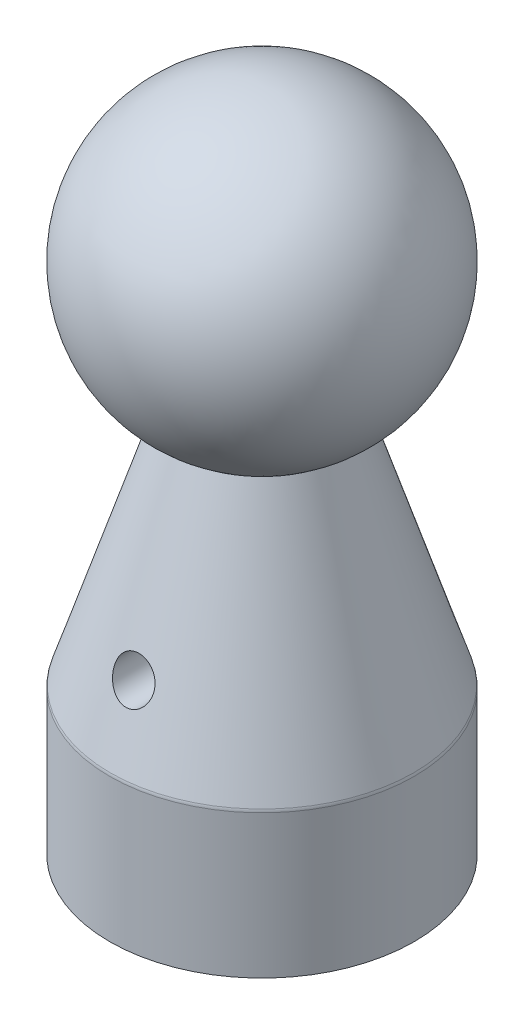
ISO-10303-21;
HEADER;
FILE_DESCRIPTION(('STEP AP214'),'2;1');
FILE_NAME('part.step','',(''),(''),'','','');
FILE_SCHEMA(('AUTOMOTIVE_DESIGN { 1 0 10303 214 1 1 1 1 }'));
ENDSEC;
DATA;
#1=APPLICATION_CONTEXT('core data for automotive mechanical design processes');
#2=APPLICATION_PROTOCOL_DEFINITION('international standard','automotive_design',2000,#1);
#3=PRODUCT_CONTEXT('',#1,'mechanical');
#4=PRODUCT('Part','Part','',(#3));
#5=PRODUCT_RELATED_PRODUCT_CATEGORY('part','',(#4));
#6=PRODUCT_DEFINITION_FORMATION('','',#4);
#7=PRODUCT_DEFINITION_CONTEXT('part definition',#1,'design');
#8=PRODUCT_DEFINITION('design','',#6,#7);
#9=PRODUCT_DEFINITION_SHAPE('','',#8);
#10=(LENGTH_UNIT() NAMED_UNIT(*) SI_UNIT(.MILLI.,.METRE.));
#11=(NAMED_UNIT(*) PLANE_ANGLE_UNIT() SI_UNIT($,.RADIAN.));
#12=(NAMED_UNIT(*) SI_UNIT($,.STERADIAN.) SOLID_ANGLE_UNIT());
#13=UNCERTAINTY_MEASURE_WITH_UNIT(LENGTH_MEASURE(1.E-05),#10,'distance_accuracy_value','');
#14=(GEOMETRIC_REPRESENTATION_CONTEXT(3) GLOBAL_UNCERTAINTY_ASSIGNED_CONTEXT((#13)) GLOBAL_UNIT_ASSIGNED_CONTEXT((#10,
#11,#12)) REPRESENTATION_CONTEXT('',''));
#15=CARTESIAN_POINT('',(0.,0.,0.));
#16=DIRECTION('',(0.,0.,1.));
#17=DIRECTION('',(1.,0.,0.));
#18=AXIS2_PLACEMENT_3D('',#15,#16,#17);
#19=CARTESIAN_POINT('',(0.,85.598,0.));
#20=DIRECTION('',(0.,-1.,0.));
#21=DIRECTION('',(1.,0.,0.));
#22=AXIS2_PLACEMENT_3D('',#19,#20,#21);
#23=SPHERICAL_SURFACE('',#22,25.4);
#24=CARTESIAN_POINT('',(0.,63.6009547438753,0.));
#25=DIRECTION('',(0.,-1.,0.));
#26=DIRECTION('',(0.,0.,-1.));
#27=AXIS2_PLACEMENT_3D('',#24,#25,#26);
#28=CIRCLE('',#27,12.7);
#29=CARTESIAN_POINT('',(0.,63.6009547438753,-12.7));
#30=VERTEX_POINT('',#29);
#31=EDGE_CURVE('E116',#30,#30,#28,.T.);
#32=ORIENTED_EDGE('',*,*,#31,.F.);
#33=EDGE_LOOP('',(#32));
#34=FACE_BOUND('',#33,.T.);
#35=ADVANCED_FACE('F33',(#34),#23,.T.);
#36=CARTESIAN_POINT('',(0.,24.13,0.));
#37=DIRECTION('',(0.,-1.,0.));
#38=DIRECTION('',(0.,0.,-1.));
#39=AXIS2_PLACEMENT_3D('',#36,#37,#38);
#40=CONICAL_SURFACE('',#39,25.4,0.311294640774793);
#41=CARTESIAN_POINT('',(0.,24.3690295241415,0.));
#42=DIRECTION('',(0.,1.,0.));
#43=DIRECTION('',(0.,0.,1.));
#44=AXIS2_PLACEMENT_3D('',#41,#42,#43);
#45=CIRCLE('',#44,25.3230909164398);
#46=CARTESIAN_POINT('',(0.,24.3690295241415,25.3230909164398));
#47=VERTEX_POINT('',#46);
#48=EDGE_CURVE('E91',#47,#47,#45,.T.);
#49=ORIENTED_EDGE('',*,*,#48,.T.);
#50=EDGE_LOOP('',(#49));
#51=FACE_BOUND('',#50,.T.);
#52=CARTESIAN_POINT('',(-1.60081995492145,32.9171004117086,-22.515866046003));
#53=CARTESIAN_POINT('',(-1.77169788196926,33.0095127195048,-22.4739061474421));
#54=CARTESIAN_POINT('',(-1.93358693573494,33.1162395795657,-22.4259538926566));
#55=CARTESIAN_POINT('',(-2.2352223082019,33.3541231544109,-22.3209881055093));
#56=CARTESIAN_POINT('',(-2.37491986401619,33.4853323278317,-22.2639551550318));
#57=CARTESIAN_POINT('',(-2.62859309077032,33.7673105377345,-22.1440686216835));
#58=CARTESIAN_POINT('',(-2.74266338501602,33.9180042707433,-22.0812377013193));
#59=CARTESIAN_POINT('',(-2.9435824800794,34.2351949360935,-21.9523880493859));
#60=CARTESIAN_POINT('',(-3.03043976139563,34.4016869240477,-21.8863703183512));
#61=CARTESIAN_POINT('',(-3.17934781132035,34.7561980424798,-21.7499833022259));
#62=CARTESIAN_POINT('',(-3.23974441329069,34.9448999504454,-21.6795767139967));
#63=CARTESIAN_POINT('',(-3.32667204596179,35.3307299516955,-21.5408036008511));
#64=CARTESIAN_POINT('',(-3.35319541140584,35.5278599417646,-21.472437541108));
#65=CARTESIAN_POINT('',(-3.37113288143676,35.9275157236945,-21.3394537909924));
#66=CARTESIAN_POINT('',(-3.36214497733018,36.1300773657507,-21.2748874668051));
#67=CARTESIAN_POINT('',(-3.30741898856899,36.532269053735,-21.1524944705222));
#68=CARTESIAN_POINT('',(-3.26169057747519,36.7318998572492,-21.09466602897));
#69=CARTESIAN_POINT('',(-3.1364863619104,37.1134981785572,-20.9895012770649));
#70=CARTESIAN_POINT('',(-3.0584787035577,37.2958545666885,-20.9418308310241));
#71=CARTESIAN_POINT('',(-2.87055780889468,37.6455049635914,-20.8548579218339));
#72=CARTESIAN_POINT('',(-2.76065417326665,37.8128034849545,-20.8155529468414));
#73=CARTESIAN_POINT('',(-2.51796421706855,38.1186354962833,-20.7471463477041));
#74=CARTESIAN_POINT('',(-2.38655756202974,38.258174774934,-20.7176401635573));
#75=CARTESIAN_POINT('',(-2.10115061389559,38.5134811164614,-20.6659592279342));
#76=CARTESIAN_POINT('',(-1.94715357152892,38.6292515938973,-20.6437834231166));
#77=CARTESIAN_POINT('',(-1.62530092888828,38.8304792241158,-20.6066348511495));
#78=CARTESIAN_POINT('',(-1.45790487702004,38.9166408309097,-20.5914911481932));
#79=CARTESIAN_POINT('',(-1.11073681107022,39.0599699636262,-20.5669486567397));
#80=CARTESIAN_POINT('',(-0.930965341812602,39.1171387650223,-20.5575496155152));
#81=CARTESIAN_POINT('',(-0.565400121999948,39.2004257332904,-20.5440315486752));
#82=CARTESIAN_POINT('',(-0.379652457237204,39.2267409370291,-20.5398790045709));
#83=CARTESIAN_POINT('',(-0.00632056599214067,39.2481836031241,-20.5364870241591));
#84=CARTESIAN_POINT('',(0.181263651493457,39.2433112181829,-20.537247563796));
#85=CARTESIAN_POINT('',(0.55287375808255,39.202533516835,-20.5437292313035));
#86=CARTESIAN_POINT('',(0.73690087383713,39.1666391007283,-20.5494486167725));
#87=CARTESIAN_POINT('',(1.09623731394046,39.0649313948789,-20.5661863953247));
#88=CARTESIAN_POINT('',(1.27154676882699,38.9991185532828,-20.5772047090355));
#89=CARTESIAN_POINT('',(1.60847823500165,38.8396152490303,-20.6050902044283));
#90=CARTESIAN_POINT('',(1.77010055573184,38.74592541684,-20.6219572538366));
#91=CARTESIAN_POINT('',(2.07512852699926,38.5336174874511,-20.6621559744277));
#92=CARTESIAN_POINT('',(2.21853469017169,38.4150000920083,-20.6854874636308));
#93=CARTESIAN_POINT('',(2.48357603176383,38.1562760590021,-20.7391874785798));
#94=CARTESIAN_POINT('',(2.60515704448015,38.0161175164329,-20.7695730945431));
#95=CARTESIAN_POINT('',(2.8230490127132,37.7189503224156,-20.8375736396536));
#96=CARTESIAN_POINT('',(2.91935904832056,37.5619410578638,-20.8751888318841));
#97=CARTESIAN_POINT('',(3.0858474693396,37.2334311439929,-20.9580783779635));
#98=CARTESIAN_POINT('',(3.15561565162616,37.0617496135242,-21.0034583805546));
#99=CARTESIAN_POINT('',(3.2658302271823,36.7110199060286,-21.1008035995783));
#100=CARTESIAN_POINT('',(3.30627157775522,36.5319704676935,-21.1527699467173));
#101=CARTESIAN_POINT('',(3.35855084882029,36.1645970180641,-21.2642112235703));
#102=CARTESIAN_POINT('',(3.36926304402898,35.9761765054735,-21.3238942158727));
#103=CARTESIAN_POINT('',(3.35940211055684,35.6015489817989,-21.4474652555152));
#104=CARTESIAN_POINT('',(3.33882046707852,35.4153425870529,-21.5113544428009));
#105=CARTESIAN_POINT('',(3.26560197709921,35.040406664999,-21.644606411587));
#106=CARTESIAN_POINT('',(3.21140469251208,34.8520214159268,-21.7140828651945));
#107=CARTESIAN_POINT('',(3.07120170604291,34.487359025658,-21.8528453565399));
#108=CARTESIAN_POINT('',(2.98518725657129,34.3110852301183,-21.9221313366279));
#109=CARTESIAN_POINT('',(2.7805755887529,33.9708231108567,-22.0593862312286));
#110=CARTESIAN_POINT('',(2.66118432723226,33.8072772221322,-22.127273180414));
#111=CARTESIAN_POINT('',(2.39339471777119,33.5027715202075,-22.2563771665706));
#112=CARTESIAN_POINT('',(2.24499951945429,33.3618092576061,-22.3175949266458));
#113=CARTESIAN_POINT('',(1.92853808155096,33.112281592432,-22.4277019918914));
#114=CARTESIAN_POINT('',(1.76138865552553,33.0027206893357,-22.476960017018));
#115=CARTESIAN_POINT('',(1.40775605049878,32.8140234262954,-22.562701301982));
#116=CARTESIAN_POINT('',(1.2212876887206,32.7348639652347,-22.5991942597112));
#117=CARTESIAN_POINT('',(0.85206777303415,32.6163969662248,-22.6541281515917));
#118=CARTESIAN_POINT('',(0.670441153247138,32.5741883610721,-22.6738782517462));
#119=CARTESIAN_POINT('',(0.301712015868256,32.520385283012,-22.6990903192571));
#120=CARTESIAN_POINT('',(0.114610949725953,32.5087827685054,-22.7045560397602));
#121=CARTESIAN_POINT('',(-0.245440837249479,32.5164763281566,-22.7009415887368));
#122=CARTESIAN_POINT('',(-0.418453693272142,32.5336385928087,-22.6928659157828));
#123=CARTESIAN_POINT('',(-0.758664327321565,32.5940878879045,-22.664577207721));
#124=CARTESIAN_POINT('',(-0.92586890296361,32.6373432110716,-22.6443789037167));
#125=CARTESIAN_POINT('',(-1.17685421401854,32.7230631536632,-22.6046981440832));
#126=CARTESIAN_POINT('',(-1.26424186677273,32.7570818623425,-22.5890031842886));
#127=CARTESIAN_POINT('',(-1.43537750558153,32.8320105609227,-22.5546170989774));
#128=CARTESIAN_POINT('',(-1.51912599693699,32.8729195902253,-22.5359263911236));
#129=CARTESIAN_POINT('',(-1.60081995492145,32.9171004117086,-22.515866046003));
#130=B_SPLINE_CURVE_WITH_KNOTS('',3,(#52,#53,#54,#55,#56,#57,#58,#59,#60,#61,#62,#63,#64,#65,
#66,#67,#68,#69,#70,#71,#72,#73,#74,#75,#76,#77,#78,#79,#80,#81,#82,#83,#84,#85,#86,#87,#88,#89,
#90,#91,#92,#93,#94,#95,#96,#97,#98,#99,#100,#101,#102,#103,#104,#105,#106,#107,#108,#109,#110,
#111,#112,#113,#114,#115,#116,#117,#118,#119,#120,#121,#122,#123,#124,#125,#126,#127,#128,#129),
.UNSPECIFIED.,.T.,.F.,(4,2,2,2,2,2,2,2,2,2,2,2,2,2,2,2,2,2,2,2,2,2,2,2,2,2,2,2,2,2,2,2,2,2,2,2,
2,2,4),(0.,0.595860698813477,1.19301313291908,1.7879230813272,2.38264745077268,3.01054918118957,
3.63859297584696,4.2737668574799,4.90877355632428,5.51761574019164,6.12627485242643,
6.70520855554136,7.2840590323879,7.84798868100089,8.41189351864113,8.97217719281128,
9.53245812369163,10.092542267057,10.6526180212263,11.2126811096847,11.7727284334741,
12.3341470257949,12.8955860519357,13.4653800602326,14.0352720203819,14.6264669349581,
15.2178227376222,15.838926395377,16.4602009421163,17.097740012527,17.7352098891058,
18.3493886916542,18.9630998709384,19.5226360074754,20.0820251140057,20.6017263175086,
21.120797268762,21.4057082659504,21.6905795757472),.UNSPECIFIED.);
#131=CARTESIAN_POINT('',(-1.60081995492145,32.9171004117086,-22.515866046003));
#132=VERTEX_POINT('',#131);
#133=EDGE_CURVE('E105',#132,#132,#130,.T.);
#134=ORIENTED_EDGE('',*,*,#133,.F.);
#135=EDGE_LOOP('',(#134));
#136=FACE_BOUND('',#135,.T.);
#137=CARTESIAN_POINT('',(-2.21054354102512,33.3397671608585,22.3275451101706));
#138=CARTESIAN_POINT('',(-2.07654075808737,33.2230442538149,22.3785512016898));
#139=CARTESIAN_POINT('',(-1.93248495105923,33.1162562442471,22.426051927024));
#140=CARTESIAN_POINT('',(-1.62711138176537,32.9259830443976,22.5116527733888));
#141=CARTESIAN_POINT('',(-1.46579197316271,32.8425000793373,22.5497519967011));
#142=CARTESIAN_POINT('',(-1.12919560091443,32.7018316209413,22.6144294404377));
#143=CARTESIAN_POINT('',(-0.953874754481708,32.6447329434331,22.6409696103004));
#144=CARTESIAN_POINT('',(-0.594815213300432,32.5598532980217,22.6805626317122));
#145=CARTESIAN_POINT('',(-0.411079713177631,32.5320612985411,22.6936205581893));
#146=CARTESIAN_POINT('',(-0.0509748570106106,32.5078093364224,22.7050121743618));
#147=CARTESIAN_POINT('',(0.125265214863852,32.5097584990166,22.7040934904253));
#148=CARTESIAN_POINT('',(0.47473067161913,32.5410364073462,22.6894094313141));
#149=CARTESIAN_POINT('',(0.647956349157053,32.5703624798742,22.675645310427));
#150=CARTESIAN_POINT('',(0.983042728128543,32.6542306092878,22.6365581239452));
#151=CARTESIAN_POINT('',(1.14506137164754,32.7082570153763,22.6114715596518));
#152=CARTESIAN_POINT('',(1.45751027468657,32.8392489788271,22.5512504412025));
#153=CARTESIAN_POINT('',(1.60793847465863,32.9162186012767,22.5161141064693));
#154=CARTESIAN_POINT('',(1.90149787911811,33.0950636775883,22.4355272552635));
#155=CARTESIAN_POINT('',(2.04384483655963,33.1980246675297,22.389635977981));
#156=CARTESIAN_POINT('',(2.30952364141363,33.4233076458578,22.2909225769689));
#157=CARTESIAN_POINT('',(2.43284848916833,33.5456367278198,22.2380979150999));
#158=CARTESIAN_POINT('',(2.66821864596592,33.8178149622426,22.1229388725166));
#159=CARTESIAN_POINT('',(2.77836063459523,33.9691302544568,22.060177094001));
#160=CARTESIAN_POINT('',(2.97177127866029,34.2869636306225,21.9317633193434));
#161=CARTESIAN_POINT('',(3.05502964107708,34.4534875063026,21.8661102271018));
#162=CARTESIAN_POINT('',(3.19764364568196,34.8094069717724,21.7299861504662));
#163=CARTESIAN_POINT('',(3.25502309916537,34.9995874558643,21.6594871930031));
#164=CARTESIAN_POINT('',(3.33559771885762,35.3879045058658,21.5208001329401));
#165=CARTESIAN_POINT('',(3.35878899031304,35.5860419756028,21.4526122944897));
#166=CARTESIAN_POINT('',(3.36973766131548,35.9864961357795,21.3204585637588));
#167=CARTESIAN_POINT('',(3.35721264919334,36.1888335065038,21.2565304339693));
#168=CARTESIAN_POINT('',(3.29547162035742,36.5899599447216,21.1355759054749));
#169=CARTESIAN_POINT('',(3.24626548672073,36.7887499532193,21.0785476525303));
#170=CARTESIAN_POINT('',(3.11452989348966,37.1677766672248,20.9751233190894));
#171=CARTESIAN_POINT('',(3.03351383522905,37.348443179548,20.9283771043999));
#172=CARTESIAN_POINT('',(2.83996689902301,37.69419808514,20.8432465280885));
#173=CARTESIAN_POINT('',(2.72744519773123,37.8592909958427,20.8048597373949));
#174=CARTESIAN_POINT('',(2.48004217629906,38.1605099138499,20.7381583417516));
#175=CARTESIAN_POINT('',(2.3464974471831,38.2976475689645,20.7094479302694));
#176=CARTESIAN_POINT('',(2.05730255517777,38.547824564716,20.6592796554673));
#177=CARTESIAN_POINT('',(1.90165547303058,38.6608672583524,20.6378207827963));
#178=CARTESIAN_POINT('',(1.57687198587387,38.8566173865141,20.601975647778));
#179=CARTESIAN_POINT('',(1.40816053093459,38.9400013950946,20.587428692342));
#180=CARTESIAN_POINT('',(1.05886550308319,39.0775973903848,20.5640151126512));
#181=CARTESIAN_POINT('',(0.878282405168741,39.1318105434568,20.5551482612816));
#182=CARTESIAN_POINT('',(0.511514882989358,39.2091461566815,20.5426434776394));
#183=CARTESIAN_POINT('',(0.325369453576461,39.2324488279581,20.5389752283563));
#184=CARTESIAN_POINT('',(-0.048239977003703,39.2478437495606,20.5365420952787));
#185=CARTESIAN_POINT('',(-0.235703972165438,39.2399361419449,20.5377771891658));
#186=CARTESIAN_POINT('',(-0.60657449616069,39.1931569978996,20.5452284438233));
#187=CARTESIAN_POINT('',(-0.789982119993264,39.154293925252,20.5514432430552));
#188=CARTESIAN_POINT('',(-1.14758279494182,39.0468059188768,20.5692179998535));
#189=CARTESIAN_POINT('',(-1.32177599747469,38.9781814743764,20.580777869556));
#190=CARTESIAN_POINT('',(-1.65601432942238,38.8133014228978,20.6098062663162));
#191=CARTESIAN_POINT('',(-1.81605964381611,38.7170461772531,20.6272747161067));
#192=CARTESIAN_POINT('',(-2.11752446769141,38.4999385387382,20.6687332801189));
#193=CARTESIAN_POINT('',(-2.25894448107946,38.3790868115498,20.6927232178482));
#194=CARTESIAN_POINT('',(-2.51971315098049,38.1162499376552,20.7477871803155));
#195=CARTESIAN_POINT('',(-2.63899976772579,37.974207342525,20.7788805882415));
#196=CARTESIAN_POINT('',(-2.85203980353185,37.6737151365774,20.8483029815748));
#197=CARTESIAN_POINT('',(-2.94579206950095,37.515264785257,20.8866322936122));
#198=CARTESIAN_POINT('',(-3.10703314078409,37.1841666347855,20.9709623431802));
#199=CARTESIAN_POINT('',(-3.17408276332521,37.011333815121,21.0170749009808));
#200=CARTESIAN_POINT('',(-3.2787249398078,36.65877290623,21.1158098322233));
#201=CARTESIAN_POINT('',(-3.3163130187414,36.4790437738478,21.1684331932069));
#202=CARTESIAN_POINT('',(-3.36274714308496,36.1105611152648,21.2811479602852));
#203=CARTESIAN_POINT('',(-3.37043399708605,35.9217260845262,21.3414485507486));
#204=CARTESIAN_POINT('',(-3.35446301753251,35.546706008547,21.466100945559));
#205=CARTESIAN_POINT('',(-3.33079199494391,35.3605221116631,21.5304544437019));
#206=CARTESIAN_POINT('',(-3.25121918354555,34.9860820586728,21.6644539409375));
#207=CARTESIAN_POINT('',(-3.19375181638865,34.7981951116974,21.7342031627171));
#208=CARTESIAN_POINT('',(-3.04704323589227,34.4351312120184,21.873205478554));
#209=CARTESIAN_POINT('',(-2.95781479811176,34.25994918295,21.9424587606888));
#210=CARTESIAN_POINT('',(-2.76646671555921,33.9538691651925,22.0665736873455));
#211=CARTESIAN_POINT('',(-2.66877510588213,33.8203940272344,22.1219496888089));
#212=CARTESIAN_POINT('',(-2.45386852685771,33.5682707567345,22.2284330991398));
#213=CARTESIAN_POINT('',(-2.33665818761639,33.4496191195134,22.2795415160293));
#214=CARTESIAN_POINT('',(-2.21054354102512,33.3397671608585,22.3275451101706));
#215=B_SPLINE_CURVE_WITH_KNOTS('',3,(#137,#138,#139,#140,#141,#142,#143,#144,#145,#146,#147,
#148,#149,#150,#151,#152,#153,#154,#155,#156,#157,#158,#159,#160,#161,#162,#163,#164,#165,#166,
#167,#168,#169,#170,#171,#172,#173,#174,#175,#176,#177,#178,#179,#180,#181,#182,#183,#184,#185,
#186,#187,#188,#189,#190,#191,#192,#193,#194,#195,#196,#197,#198,#199,#200,#201,#202,#203,#204,
#205,#206,#207,#208,#209,#210,#211,#212,#213,#214),.UNSPECIFIED.,.T.,.F.,(4,2,2,2,2,2,2,2,2,2,2,
2,2,2,2,2,2,2,2,2,2,2,2,2,2,2,2,2,2,2,2,2,2,2,2,2,2,2,4),(0.,0.554108117323079,1.10826912413037,
1.66424080099584,2.22000312501987,2.7461466236383,3.2722387525596,3.78781699986994,
4.30348665187179,4.84592716719068,5.38856681321316,5.9782261511173,6.56811098678951,
7.1975342520022,7.8270292162313,8.46151541940805,9.09583073329892,9.70304762820729,
10.3100878426115,10.8879154840392,11.4656626637244,12.0292267432099,12.5927682875767,
13.153009674495,13.7132485113909,14.2733342214513,14.8334107249873,15.3934799046268,
15.9535339285117,16.5151348176174,17.0767610635446,17.6472766792862,18.2178789356806,
18.8103936076067,19.4031575686633,20.0258221759135,20.6482366053327,21.1698504478148,
21.6913407322518),.UNSPECIFIED.);
#216=CARTESIAN_POINT('',(-2.21054354102512,33.3397671608585,22.3275451101706));
#217=VERTEX_POINT('',#216);
#218=EDGE_CURVE('E111',#217,#217,#215,.T.);
#219=ORIENTED_EDGE('',*,*,#218,.F.);
#220=EDGE_LOOP('',(#219));
#221=FACE_BOUND('',#220,.T.);
#222=ORIENTED_EDGE('',*,*,#31,.T.);
#223=EDGE_LOOP('',(#222));
#224=FACE_BOUND('',#223,.T.);
#225=ADVANCED_FACE('F61',(#51,#136,#221,#224),#40,.T.);
#226=CARTESIAN_POINT('',(0.,0.,0.));
#227=DIRECTION('',(0.,-1.,0.));
#228=DIRECTION('',(0.,0.,-1.));
#229=AXIS2_PLACEMENT_3D('',#226,#227,#228);
#230=CYLINDRICAL_SURFACE('',#229,25.4);
#231=CARTESIAN_POINT('',(0.,23.8789021693734,0.));
#232=DIRECTION('',(0.,1.,0.));
#233=DIRECTION('',(0.,0.,1.));
#234=AXIS2_PLACEMENT_3D('',#231,#232,#233);
#235=CIRCLE('',#234,25.4);
#236=CARTESIAN_POINT('',(0.,23.8789021693734,25.4));
#237=VERTEX_POINT('',#236);
#238=EDGE_CURVE('E95',#237,#237,#235,.F.);
#239=ORIENTED_EDGE('',*,*,#238,.T.);
#240=EDGE_LOOP('',(#239));
#241=FACE_BOUND('',#240,.T.);
#242=CARTESIAN_POINT('',(0.,0.,0.));
#243=DIRECTION('',(0.,-1.,0.));
#244=DIRECTION('',(0.,0.,-1.));
#245=AXIS2_PLACEMENT_3D('',#242,#243,#244);
#246=CIRCLE('',#245,25.4);
#247=CARTESIAN_POINT('',(0.,0.,-25.4));
#248=VERTEX_POINT('',#247);
#249=EDGE_CURVE('E108',#248,#248,#246,.T.);
#250=ORIENTED_EDGE('',*,*,#249,.F.);
#251=EDGE_LOOP('',(#250));
#252=FACE_BOUND('',#251,.T.);
#253=ADVANCED_FACE('F67',(#241,#252),#230,.T.);
#254=CARTESIAN_POINT('',(25.4,0.,0.));
#255=DIRECTION('',(0.,-1.,0.));
#256=DIRECTION('',(0.,0.,-1.));
#257=AXIS2_PLACEMENT_3D('',#254,#255,#256);
#258=PLANE('',#257);
#259=CARTESIAN_POINT('',(0.,0.,0.));
#260=DIRECTION('',(0.,-1.,0.));
#261=DIRECTION('',(0.,0.,-1.));
#262=AXIS2_PLACEMENT_3D('',#259,#260,#261);
#263=CIRCLE('',#262,17.6149);
#264=CARTESIAN_POINT('',(0.,0.,-17.6149));
#265=VERTEX_POINT('',#264);
#266=EDGE_CURVE('E86',#265,#265,#263,.F.);
#267=ORIENTED_EDGE('',*,*,#266,.T.);
#268=EDGE_LOOP('',(#267));
#269=FACE_BOUND('',#268,.T.);
#270=ORIENTED_EDGE('',*,*,#249,.T.);
#271=EDGE_LOOP('',(#270));
#272=FACE_BOUND('',#271,.T.);
#273=ADVANCED_FACE('F132',(#269,#272),#258,.T.);
#274=CARTESIAN_POINT('',(0.,0.,0.));
#275=DIRECTION('',(0.,-1.,0.));
#276=DIRECTION('',(0.,0.,-1.));
#277=AXIS2_PLACEMENT_3D('',#274,#275,#276);
#278=CYLINDRICAL_SURFACE('',#277,17.145);
#279=CARTESIAN_POINT('',(0.,0.469900000000006,0.));
#280=DIRECTION('',(0.,-1.,0.));
#281=DIRECTION('',(0.,0.,-1.));
#282=AXIS2_PLACEMENT_3D('',#279,#280,#281);
#283=CIRCLE('',#282,17.145);
#284=CARTESIAN_POINT('',(0.,0.469900000000006,-17.145));
#285=VERTEX_POINT('',#284);
#286=EDGE_CURVE('E89',#285,#285,#283,.T.);
#287=ORIENTED_EDGE('',*,*,#286,.T.);
#288=EDGE_LOOP('',(#287));
#289=FACE_BOUND('',#288,.T.);
#290=CARTESIAN_POINT('',(0.,0.507999999999999,0.));
#291=DIRECTION('',(0.,-1.,0.));
#292=DIRECTION('',(0.,0.,-1.));
#293=AXIS2_PLACEMENT_3D('',#290,#291,#292);
#294=CIRCLE('',#293,17.145);
#295=CARTESIAN_POINT('',(0.,0.507999999999999,-17.145));
#296=VERTEX_POINT('',#295);
#297=EDGE_CURVE('E104',#296,#296,#294,.T.);
#298=ORIENTED_EDGE('',*,*,#297,.F.);
#299=EDGE_LOOP('',(#298));
#300=FACE_BOUND('',#299,.T.);
#301=ADVANCED_FACE('F136',(#289,#300),#278,.F.);
#302=CARTESIAN_POINT('',(17.145,0.507999999999998,0.));
#303=DIRECTION('',(0.,-1.,0.));
#304=DIRECTION('',(0.,0.,-1.));
#305=AXIS2_PLACEMENT_3D('',#302,#303,#304);
#306=PLANE('',#305);
#307=CARTESIAN_POINT('',(0.,0.507999999999998,0.));
#308=DIRECTION('',(0.,-1.,0.));
#309=DIRECTION('',(0.,0.,-1.));
#310=AXIS2_PLACEMENT_3D('',#307,#308,#309);
#311=CIRCLE('',#310,4.80059999999999);
#312=CARTESIAN_POINT('',(0.,0.507999999999998,-4.80059999999999));
#313=VERTEX_POINT('',#312);
#314=EDGE_CURVE('E11',#313,#313,#311,.F.);
#315=ORIENTED_EDGE('',*,*,#314,.T.);
#316=EDGE_LOOP('',(#315));
#317=FACE_BOUND('',#316,.T.);
#318=ORIENTED_EDGE('',*,*,#297,.T.);
#319=EDGE_LOOP('',(#318));
#320=FACE_BOUND('',#319,.T.);
#321=ADVANCED_FACE('F56',(#317,#320),#306,.T.);
#322=CARTESIAN_POINT('',(0.,0.,0.));
#323=DIRECTION('',(0.,-1.,0.));
#324=DIRECTION('',(0.,0.,-1.));
#325=AXIS2_PLACEMENT_3D('',#322,#323,#324);
#326=CYLINDRICAL_SURFACE('',#325,4.1656);
#327=CARTESIAN_POINT('',(0.,1.14299999999999,0.));
#328=DIRECTION('',(0.,-1.,0.));
#329=DIRECTION('',(0.,0.,-1.));
#330=AXIS2_PLACEMENT_3D('',#327,#328,#329);
#331=CIRCLE('',#330,4.1656);
#332=CARTESIAN_POINT('',(0.,1.14299999999999,-4.1656));
#333=VERTEX_POINT('',#332);
#334=EDGE_CURVE('E40',#333,#333,#331,.T.);
#335=ORIENTED_EDGE('',*,*,#334,.T.);
#336=EDGE_LOOP('',(#335));
#337=FACE_BOUND('',#336,.T.);
#338=CARTESIAN_POINT('',(0.,26.0720550053788,0.));
#339=DIRECTION('',(0.,-1.,0.));
#340=DIRECTION('',(0.,0.,-1.));
#341=AXIS2_PLACEMENT_3D('',#338,#339,#340);
#342=CIRCLE('',#341,4.1656);
#343=CARTESIAN_POINT('',(0.,26.0720550053788,-4.1656));
#344=VERTEX_POINT('',#343);
#345=EDGE_CURVE('E103',#344,#344,#342,.T.);
#346=ORIENTED_EDGE('',*,*,#345,.F.);
#347=EDGE_LOOP('',(#346));
#348=FACE_BOUND('',#347,.T.);
#349=ADVANCED_FACE('F46',(#337,#348),#326,.F.);
#350=CARTESIAN_POINT('',(0.,28.575,0.));
#351=DIRECTION('',(0.,-1.,0.));
#352=DIRECTION('',(0.,0.,-1.));
#353=AXIS2_PLACEMENT_3D('',#350,#351,#352);
#354=CONICAL_SURFACE('',#353,0.,1.02974425867666);
#355=ORIENTED_EDGE('',*,*,#345,.T.);
#356=EDGE_LOOP('',(#355));
#357=FACE_BOUND('',#356,.T.);
#358=CARTESIAN_POINT('',(0.,28.575,0.));
#359=VERTEX_POINT('',#358);
#360=VERTEX_LOOP('',#359);
#361=FACE_BOUND('',#360,.T.);
#362=ADVANCED_FACE('F43',(#357,#361),#354,.F.);
#363=CARTESIAN_POINT('',(0.,35.8775,-25.4));
#364=DIRECTION('',(0.,0.,1.));
#365=DIRECTION('',(1.,0.,0.));
#366=AXIS2_PLACEMENT_3D('',#363,#364,#365);
#367=CYLINDRICAL_SURFACE('',#366,3.3655);
#368=ORIENTED_EDGE('',*,*,#133,.T.);
#369=EDGE_LOOP('',(#368));
#370=FACE_BOUND('',#369,.T.);
#371=ORIENTED_EDGE('',*,*,#218,.T.);
#372=EDGE_LOOP('',(#371));
#373=FACE_BOUND('',#372,.T.);
#374=ADVANCED_FACE('F45',(#370,#373),#367,.F.);
#375=CARTESIAN_POINT('',(0.,23.8789021693734,0.));
#376=DIRECTION('',(0.,1.,0.));
#377=DIRECTION('',(0.,0.,1.));
#378=AXIS2_PLACEMENT_3D('',#375,#376,#377);
#379=TOROIDAL_SURFACE('',#378,23.7998,1.6002);
#380=ORIENTED_EDGE('',*,*,#48,.F.);
#381=EDGE_LOOP('',(#380));
#382=FACE_BOUND('',#381,.T.);
#383=ORIENTED_EDGE('',*,*,#238,.F.);
#384=EDGE_LOOP('',(#383));
#385=FACE_BOUND('',#384,.T.);
#386=ADVANCED_FACE('F53',(#382,#385),#379,.T.);
#387=CARTESIAN_POINT('',(0.,0.469900000000006,0.));
#388=DIRECTION('',(0.,-1.,0.));
#389=DIRECTION('',(0.,0.,-1.));
#390=AXIS2_PLACEMENT_3D('',#387,#388,#389);
#391=CONICAL_SURFACE('',#390,17.145,0.785398163397459);
#392=ORIENTED_EDGE('',*,*,#266,.F.);
#393=EDGE_LOOP('',(#392));
#394=FACE_BOUND('',#393,.T.);
#395=ORIENTED_EDGE('',*,*,#286,.F.);
#396=EDGE_LOOP('',(#395));
#397=FACE_BOUND('',#396,.T.);
#398=ADVANCED_FACE('F75',(#394,#397),#391,.F.);
#399=CARTESIAN_POINT('',(0.,1.14299999999999,0.));
#400=DIRECTION('',(0.,-1.,0.));
#401=DIRECTION('',(0.,0.,-1.));
#402=AXIS2_PLACEMENT_3D('',#399,#400,#401);
#403=CONICAL_SURFACE('',#402,4.1656,0.785398163397448);
#404=ORIENTED_EDGE('',*,*,#314,.F.);
#405=EDGE_LOOP('',(#404));
#406=FACE_BOUND('',#405,.T.);
#407=ORIENTED_EDGE('',*,*,#334,.F.);
#408=EDGE_LOOP('',(#407));
#409=FACE_BOUND('',#408,.T.);
#410=ADVANCED_FACE('F35',(#406,#409),#403,.F.);
#411=CLOSED_SHELL('',(#35,#225,#253,#273,#301,#321,#349,#362,#374,#386,#398,#410));
#412=MANIFOLD_SOLID_BREP('B2',#411);
#413=ADVANCED_BREP_SHAPE_REPRESENTATION('',(#18,#412),#14);
#414=SHAPE_DEFINITION_REPRESENTATION(#9,#413);
ENDSEC;
END-ISO-10303-21;
